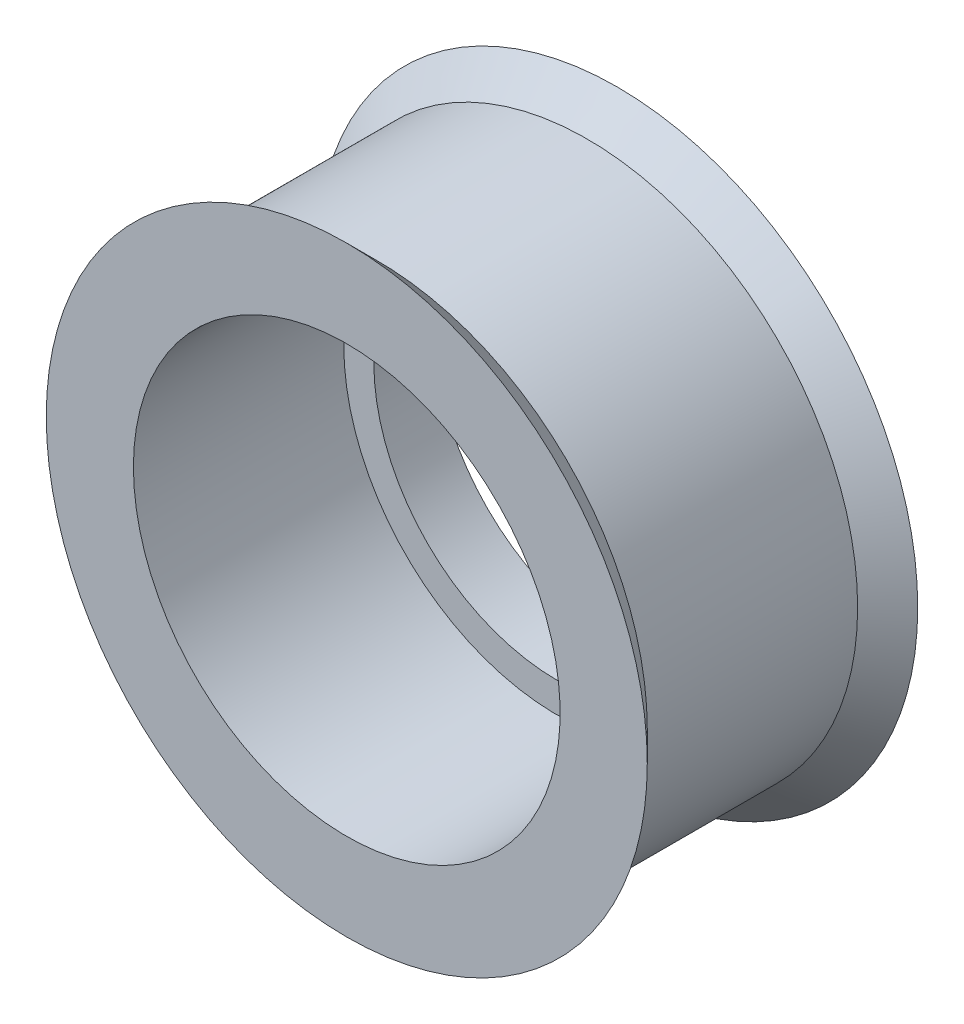
ISO-10303-21;
HEADER;
FILE_DESCRIPTION(('STEP AP214'),'2;1');
FILE_NAME('part.step','',(''),(''),'','','');
FILE_SCHEMA(('AUTOMOTIVE_DESIGN { 1 0 10303 214 1 1 1 1 }'));
ENDSEC;
DATA;
#1=APPLICATION_CONTEXT('core data for automotive mechanical design processes');
#2=APPLICATION_PROTOCOL_DEFINITION('international standard','automotive_design',2000,#1);
#3=PRODUCT_CONTEXT('',#1,'mechanical');
#4=PRODUCT('Part','Part','',(#3));
#5=PRODUCT_RELATED_PRODUCT_CATEGORY('part','',(#4));
#6=PRODUCT_DEFINITION_FORMATION('','',#4);
#7=PRODUCT_DEFINITION_CONTEXT('part definition',#1,'design');
#8=PRODUCT_DEFINITION('design','',#6,#7);
#9=PRODUCT_DEFINITION_SHAPE('','',#8);
#10=(LENGTH_UNIT() NAMED_UNIT(*) SI_UNIT(.MILLI.,.METRE.));
#11=(NAMED_UNIT(*) PLANE_ANGLE_UNIT() SI_UNIT($,.RADIAN.));
#12=(NAMED_UNIT(*) SI_UNIT($,.STERADIAN.) SOLID_ANGLE_UNIT());
#13=UNCERTAINTY_MEASURE_WITH_UNIT(LENGTH_MEASURE(1.E-05),#10,'distance_accuracy_value','');
#14=(GEOMETRIC_REPRESENTATION_CONTEXT(3) GLOBAL_UNCERTAINTY_ASSIGNED_CONTEXT((#13)) GLOBAL_UNIT_ASSIGNED_CONTEXT((#10,
#11,#12)) REPRESENTATION_CONTEXT('',''));
#15=CARTESIAN_POINT('',(0.,0.,0.));
#16=DIRECTION('',(0.,0.,1.));
#17=DIRECTION('',(1.,0.,0.));
#18=AXIS2_PLACEMENT_3D('',#15,#16,#17);
#19=CARTESIAN_POINT('',(0.,0.,4.5));
#20=DIRECTION('',(0.,0.,-0.999999999999999));
#21=DIRECTION('',(-0.999999999999999,0.,0.));
#22=AXIS2_PLACEMENT_3D('',#19,#20,#21);
#23=CYLINDRICAL_SURFACE('',#22,7.1);
#24=CARTESIAN_POINT('',(0.,0.,4.5));
#25=DIRECTION('',(0.,0.,0.999999999999999));
#26=DIRECTION('',(0.999999999999999,0.,0.));
#27=AXIS2_PLACEMENT_3D('',#24,#25,#26);
#28=CIRCLE('',#27,7.1);
#29=CARTESIAN_POINT('',(-7.1,0.,4.5));
#30=VERTEX_POINT('',#29);
#31=EDGE_CURVE('E46',#30,#30,#28,.T.);
#32=CARTESIAN_POINT('',(0.,0.,-2.5));
#33=DIRECTION('',(0.,0.,-0.999999999999999));
#34=DIRECTION('',(-0.999999999999999,0.,0.));
#35=AXIS2_PLACEMENT_3D('',#32,#33,#34);
#36=CIRCLE('',#35,7.1);
#37=CARTESIAN_POINT('',(-7.1,0.,-2.5));
#38=VERTEX_POINT('',#37);
#39=EDGE_CURVE('E56',#38,#38,#36,.T.);
#40=CARTESIAN_POINT('',(-7.1,0.,4.5));
#41=CARTESIAN_POINT('',(-7.1,0.,4.42708333333333));
#42=CARTESIAN_POINT('',(-7.1,0.,4.35416666666666));
#43=CARTESIAN_POINT('',(-7.1,0.,4.20833333333333));
#44=CARTESIAN_POINT('',(-7.1,0.,4.13541666666666));
#45=CARTESIAN_POINT('',(-7.1,0.,3.98958333333333));
#46=CARTESIAN_POINT('',(-7.1,0.,3.91666666666666));
#47=CARTESIAN_POINT('',(-7.1,0.,3.77083333333333));
#48=CARTESIAN_POINT('',(-7.1,0.,3.69791666666666));
#49=CARTESIAN_POINT('',(-7.1,0.,3.55208333333333));
#50=CARTESIAN_POINT('',(-7.1,0.,3.47916666666666));
#51=CARTESIAN_POINT('',(-7.1,0.,3.33333333333333));
#52=CARTESIAN_POINT('',(-7.1,0.,3.26041666666666));
#53=CARTESIAN_POINT('',(-7.1,0.,3.11458333333333));
#54=CARTESIAN_POINT('',(-7.1,0.,3.04166666666666));
#55=CARTESIAN_POINT('',(-7.1,0.,2.89583333333333));
#56=CARTESIAN_POINT('',(-7.1,0.,2.82291666666666));
#57=CARTESIAN_POINT('',(-7.1,0.,2.67708333333333));
#58=CARTESIAN_POINT('',(-7.1,0.,2.60416666666666));
#59=CARTESIAN_POINT('',(-7.1,0.,2.45833333333333));
#60=CARTESIAN_POINT('',(-7.1,0.,2.38541666666666));
#61=CARTESIAN_POINT('',(-7.1,0.,2.23958333333333));
#62=CARTESIAN_POINT('',(-7.1,0.,2.16666666666666));
#63=CARTESIAN_POINT('',(-7.1,0.,2.02083333333333));
#64=CARTESIAN_POINT('',(-7.1,0.,1.94791666666666));
#65=CARTESIAN_POINT('',(-7.1,0.,1.80208333333333));
#66=CARTESIAN_POINT('',(-7.1,0.,1.72916666666666));
#67=CARTESIAN_POINT('',(-7.1,0.,1.58333333333333));
#68=CARTESIAN_POINT('',(-7.1,0.,1.51041666666666));
#69=CARTESIAN_POINT('',(-7.1,0.,1.36458333333333));
#70=CARTESIAN_POINT('',(-7.1,0.,1.29166666666666));
#71=CARTESIAN_POINT('',(-7.1,0.,1.14583333333333));
#72=CARTESIAN_POINT('',(-7.1,0.,1.07291666666666));
#73=CARTESIAN_POINT('',(-7.1,0.,0.927083333333331));
#74=CARTESIAN_POINT('',(-7.1,0.,0.854166666666665));
#75=CARTESIAN_POINT('',(-7.1,0.,0.708333333333332));
#76=CARTESIAN_POINT('',(-7.1,0.,0.635416666666665));
#77=CARTESIAN_POINT('',(-7.1,0.,0.489583333333332));
#78=CARTESIAN_POINT('',(-7.1,0.,0.416666666666665));
#79=CARTESIAN_POINT('',(-7.1,0.,0.270833333333332));
#80=CARTESIAN_POINT('',(-7.1,0.,0.197916666666665));
#81=CARTESIAN_POINT('',(-7.1,0.,0.0520833333333319));
#82=CARTESIAN_POINT('',(-7.1,0.,-0.0208333333333345));
#83=CARTESIAN_POINT('',(-7.1,0.,-0.166666666666668));
#84=CARTESIAN_POINT('',(-7.1,0.,-0.239583333333334));
#85=CARTESIAN_POINT('',(-7.1,0.,-0.385416666666668));
#86=CARTESIAN_POINT('',(-7.1,0.,-0.458333333333335));
#87=CARTESIAN_POINT('',(-7.1,0.,-0.604166666666668));
#88=CARTESIAN_POINT('',(-7.1,0.,-0.677083333333335));
#89=CARTESIAN_POINT('',(-7.1,0.,-0.822916666666668));
#90=CARTESIAN_POINT('',(-7.1,0.,-0.895833333333335));
#91=CARTESIAN_POINT('',(-7.1,0.,-1.04166666666667));
#92=CARTESIAN_POINT('',(-7.1,0.,-1.11458333333334));
#93=CARTESIAN_POINT('',(-7.1,0.,-1.26041666666667));
#94=CARTESIAN_POINT('',(-7.1,0.,-1.33333333333333));
#95=CARTESIAN_POINT('',(-7.1,0.,-1.47916666666667));
#96=CARTESIAN_POINT('',(-7.1,0.,-1.55208333333333));
#97=CARTESIAN_POINT('',(-7.1,0.,-1.69791666666667));
#98=CARTESIAN_POINT('',(-7.1,0.,-1.77083333333333));
#99=CARTESIAN_POINT('',(-7.1,0.,-1.91666666666667));
#100=CARTESIAN_POINT('',(-7.1,0.,-1.98958333333333));
#101=CARTESIAN_POINT('',(-7.1,0.,-2.13541666666667));
#102=CARTESIAN_POINT('',(-7.1,0.,-2.20833333333333));
#103=CARTESIAN_POINT('',(-7.1,0.,-2.35416666666667));
#104=CARTESIAN_POINT('',(-7.1,0.,-2.42708333333333));
#105=CARTESIAN_POINT('',(-7.1,0.,-2.5));
#106=B_SPLINE_CURVE_WITH_KNOTS('',3,(#40,#41,#42,#43,#44,#45,#46,#47,#48,#49,#50,#51,#52,#53,
#54,#55,#56,#57,#58,#59,#60,#61,#62,#63,#64,#65,#66,#67,#68,#69,#70,#71,#72,#73,#74,#75,#76,#77,
#78,#79,#80,#81,#82,#83,#84,#85,#86,#87,#88,#89,#90,#91,#92,#93,#94,#95,#96,#97,#98,#99,#100,
#101,#102,#103,#104,#105),.UNSPECIFIED.,.F.,.F.,(4,2,2,2,2,2,2,2,2,2,2,2,2,2,2,2,2,2,2,2,2,2,2,
2,2,2,2,2,2,2,2,2,4),(0.,0.21875,0.4375,0.656250000000001,0.875,1.09375,1.3125,1.53125,1.75,
1.96875,2.1875,2.40625,2.625,2.84375,3.0625,3.28125,3.5,3.71875,3.9375,4.15625,4.375,4.59375,
4.8125,5.03125,5.25,5.46875,5.6875,5.90625,6.125,6.34375,6.5625,6.78125,7.),.UNSPECIFIED.);
#107=EDGE_CURVE('BSEAM37',#30,#38,#106,.T.);
#108=ORIENTED_EDGE('',*,*,#31,.T.);
#109=ORIENTED_EDGE('',*,*,#39,.T.);
#110=ORIENTED_EDGE('',*,*,#107,.T.);
#111=ORIENTED_EDGE('',*,*,#107,.F.);
#112=EDGE_LOOP('',(#108,#110,#109,#111));
#113=FACE_BOUND('',#112,.T.);
#114=ADVANCED_FACE('F37',(#113),#23,.F.);
#115=CARTESIAN_POINT('',(0.,0.,4.5));
#116=DIRECTION('',(0.,0.,0.999999999999999));
#117=DIRECTION('',(0.999999999999999,0.,0.));
#118=AXIS2_PLACEMENT_3D('',#115,#116,#117);
#119=PLANE('',#118);
#120=ORIENTED_EDGE('',*,*,#31,.F.);
#121=EDGE_LOOP('',(#120));
#122=FACE_BOUND('',#121,.T.);
#123=CARTESIAN_POINT('',(0.,0.,4.5));
#124=DIRECTION('',(0.,0.,0.999999999999999));
#125=DIRECTION('',(0.999999999999999,0.,0.));
#126=AXIS2_PLACEMENT_3D('',#123,#124,#125);
#127=CIRCLE('',#126,10.);
#128=CARTESIAN_POINT('',(9.99999999999999,0.,4.5));
#129=VERTEX_POINT('',#128);
#130=EDGE_CURVE('E10',#129,#129,#127,.T.);
#131=ORIENTED_EDGE('',*,*,#130,.T.);
#132=EDGE_LOOP('',(#131));
#133=FACE_BOUND('',#132,.T.);
#134=ADVANCED_FACE('F80',(#122,#133),#119,.T.);
#135=CARTESIAN_POINT('',(0.,0.,-4.5));
#136=DIRECTION('',(0.,0.,0.999999999999999));
#137=DIRECTION('',(0.999999999999999,0.,0.));
#138=AXIS2_PLACEMENT_3D('',#135,#136,#137);
#139=PLANE('',#138);
#140=CARTESIAN_POINT('',(0.,0.,-4.5));
#141=DIRECTION('',(0.,0.,0.999999999999999));
#142=DIRECTION('',(0.999999999999999,0.,0.));
#143=AXIS2_PLACEMENT_3D('',#140,#141,#142);
#144=CIRCLE('',#143,10.);
#145=CARTESIAN_POINT('',(9.99999999999999,0.,-4.5));
#146=VERTEX_POINT('',#145);
#147=EDGE_CURVE('E42',#146,#146,#144,.T.);
#148=ORIENTED_EDGE('',*,*,#147,.F.);
#149=EDGE_LOOP('',(#148));
#150=FACE_BOUND('',#149,.T.);
#151=CARTESIAN_POINT('',(0.,0.,-4.5));
#152=DIRECTION('',(0.,0.,-0.999999999999999));
#153=DIRECTION('',(-0.999999999999999,0.,0.));
#154=AXIS2_PLACEMENT_3D('',#151,#152,#153);
#155=CIRCLE('',#154,6.1);
#156=CARTESIAN_POINT('',(-6.1,0.,-4.5));
#157=VERTEX_POINT('',#156);
#158=EDGE_CURVE('E62',#157,#157,#155,.T.);
#159=ORIENTED_EDGE('',*,*,#158,.F.);
#160=EDGE_LOOP('',(#159));
#161=FACE_BOUND('',#160,.T.);
#162=ADVANCED_FACE('F77',(#150,#161),#139,.F.);
#163=CARTESIAN_POINT('',(0.,0.,-3.5));
#164=DIRECTION('',(0.,0.,0.999999999999999));
#165=DIRECTION('',(0.999999999999999,0.,0.));
#166=AXIS2_PLACEMENT_3D('',#163,#164,#165);
#167=CYLINDRICAL_SURFACE('',#166,9.);
#168=CARTESIAN_POINT('',(0.,0.,-3.5));
#169=DIRECTION('',(0.,0.,0.999999999999999));
#170=DIRECTION('',(0.999999999999999,0.,0.));
#171=AXIS2_PLACEMENT_3D('',#168,#169,#170);
#172=CIRCLE('',#171,9.);
#173=CARTESIAN_POINT('',(8.99999999999999,0.,-3.5));
#174=VERTEX_POINT('',#173);
#175=EDGE_CURVE('E55',#174,#174,#172,.T.);
#176=CARTESIAN_POINT('',(0.,0.,3.5));
#177=DIRECTION('',(0.,0.,0.999999999999999));
#178=DIRECTION('',(0.999999999999999,0.,0.));
#179=AXIS2_PLACEMENT_3D('',#176,#177,#178);
#180=CIRCLE('',#179,9.);
#181=CARTESIAN_POINT('',(8.99999999999999,0.,3.5));
#182=VERTEX_POINT('',#181);
#183=EDGE_CURVE('E52',#182,#182,#180,.T.);
#184=CARTESIAN_POINT('',(8.99999999999999,0.,-3.5));
#185=CARTESIAN_POINT('',(8.99999999999999,0.,-3.42708333333334));
#186=CARTESIAN_POINT('',(8.99999999999999,0.,-3.35416666666667));
#187=CARTESIAN_POINT('',(8.99999999999999,0.,-3.20833333333334));
#188=CARTESIAN_POINT('',(8.99999999999999,0.,-3.13541666666667));
#189=CARTESIAN_POINT('',(8.99999999999999,0.,-2.98958333333334));
#190=CARTESIAN_POINT('',(8.99999999999999,0.,-2.91666666666667));
#191=CARTESIAN_POINT('',(8.99999999999999,0.,-2.77083333333334));
#192=CARTESIAN_POINT('',(8.99999999999999,0.,-2.69791666666667));
#193=CARTESIAN_POINT('',(8.99999999999999,0.,-2.55208333333334));
#194=CARTESIAN_POINT('',(8.99999999999999,0.,-2.47916666666667));
#195=CARTESIAN_POINT('',(8.99999999999999,0.,-2.33333333333334));
#196=CARTESIAN_POINT('',(8.99999999999999,0.,-2.26041666666667));
#197=CARTESIAN_POINT('',(8.99999999999999,0.,-2.11458333333334));
#198=CARTESIAN_POINT('',(8.99999999999999,0.,-2.04166666666667));
#199=CARTESIAN_POINT('',(8.99999999999999,0.,-1.89583333333334));
#200=CARTESIAN_POINT('',(8.99999999999999,0.,-1.82291666666667));
#201=CARTESIAN_POINT('',(8.99999999999999,0.,-1.67708333333334));
#202=CARTESIAN_POINT('',(8.99999999999999,0.,-1.60416666666667));
#203=CARTESIAN_POINT('',(8.99999999999999,0.,-1.45833333333334));
#204=CARTESIAN_POINT('',(8.99999999999999,0.,-1.38541666666667));
#205=CARTESIAN_POINT('',(8.99999999999999,0.,-1.23958333333334));
#206=CARTESIAN_POINT('',(8.99999999999999,0.,-1.16666666666667));
#207=CARTESIAN_POINT('',(8.99999999999999,0.,-1.02083333333334));
#208=CARTESIAN_POINT('',(8.99999999999999,0.,-0.947916666666668));
#209=CARTESIAN_POINT('',(8.99999999999999,0.,-0.802083333333335));
#210=CARTESIAN_POINT('',(8.99999999999999,0.,-0.729166666666668));
#211=CARTESIAN_POINT('',(8.99999999999999,0.,-0.583333333333335));
#212=CARTESIAN_POINT('',(8.99999999999999,0.,-0.510416666666668));
#213=CARTESIAN_POINT('',(8.99999999999999,0.,-0.364583333333335));
#214=CARTESIAN_POINT('',(8.99999999999999,0.,-0.291666666666668));
#215=CARTESIAN_POINT('',(8.99999999999999,0.,-0.145833333333334));
#216=CARTESIAN_POINT('',(8.99999999999999,0.,-0.0729166666666676));
#217=CARTESIAN_POINT('',(8.99999999999999,0.,0.0729166666666657));
#218=CARTESIAN_POINT('',(8.99999999999999,0.,0.145833333333332));
#219=CARTESIAN_POINT('',(8.99999999999999,0.,0.291666666666666));
#220=CARTESIAN_POINT('',(8.99999999999999,0.,0.364583333333333));
#221=CARTESIAN_POINT('',(8.99999999999999,0.,0.510416666666666));
#222=CARTESIAN_POINT('',(8.99999999999999,0.,0.583333333333333));
#223=CARTESIAN_POINT('',(8.99999999999999,0.,0.729166666666667));
#224=CARTESIAN_POINT('',(8.99999999999999,0.,0.802083333333333));
#225=CARTESIAN_POINT('',(8.99999999999999,0.,0.947916666666667));
#226=CARTESIAN_POINT('',(8.99999999999999,0.,1.02083333333333));
#227=CARTESIAN_POINT('',(8.99999999999999,0.,1.16666666666667));
#228=CARTESIAN_POINT('',(8.99999999999999,0.,1.23958333333333));
#229=CARTESIAN_POINT('',(8.99999999999999,0.,1.38541666666667));
#230=CARTESIAN_POINT('',(8.99999999999999,0.,1.45833333333333));
#231=CARTESIAN_POINT('',(8.99999999999999,0.,1.60416666666667));
#232=CARTESIAN_POINT('',(8.99999999999999,0.,1.67708333333333));
#233=CARTESIAN_POINT('',(8.99999999999999,0.,1.82291666666667));
#234=CARTESIAN_POINT('',(8.99999999999999,0.,1.89583333333333));
#235=CARTESIAN_POINT('',(8.99999999999999,0.,2.04166666666667));
#236=CARTESIAN_POINT('',(8.99999999999999,0.,2.11458333333333));
#237=CARTESIAN_POINT('',(8.99999999999999,0.,2.26041666666667));
#238=CARTESIAN_POINT('',(8.99999999999999,0.,2.33333333333333));
#239=CARTESIAN_POINT('',(8.99999999999999,0.,2.47916666666667));
#240=CARTESIAN_POINT('',(8.99999999999999,0.,2.55208333333333));
#241=CARTESIAN_POINT('',(8.99999999999999,0.,2.69791666666667));
#242=CARTESIAN_POINT('',(8.99999999999999,0.,2.77083333333333));
#243=CARTESIAN_POINT('',(8.99999999999999,0.,2.91666666666667));
#244=CARTESIAN_POINT('',(8.99999999999999,0.,2.98958333333333));
#245=CARTESIAN_POINT('',(8.99999999999999,0.,3.13541666666667));
#246=CARTESIAN_POINT('',(8.99999999999999,0.,3.20833333333334));
#247=CARTESIAN_POINT('',(8.99999999999999,0.,3.35416666666667));
#248=CARTESIAN_POINT('',(8.99999999999999,0.,3.42708333333334));
#249=CARTESIAN_POINT('',(8.99999999999999,0.,3.5));
#250=B_SPLINE_CURVE_WITH_KNOTS('',3,(#184,#185,#186,#187,#188,#189,#190,#191,#192,#193,#194,
#195,#196,#197,#198,#199,#200,#201,#202,#203,#204,#205,#206,#207,#208,#209,#210,#211,#212,#213,
#214,#215,#216,#217,#218,#219,#220,#221,#222,#223,#224,#225,#226,#227,#228,#229,#230,#231,#232,
#233,#234,#235,#236,#237,#238,#239,#240,#241,#242,#243,#244,#245,#246,#247,#248,#249),
.UNSPECIFIED.,.F.,.F.,(4,2,2,2,2,2,2,2,2,2,2,2,2,2,2,2,2,2,2,2,2,2,2,2,2,2,2,2,2,2,2,2,4),(0.,
0.21875,0.4375,0.656250000000001,0.875000000000001,1.09375,1.3125,1.53125,1.75,1.96875,2.1875,
2.40625,2.625,2.84375,3.0625,3.28125,3.5,3.71875,3.9375,4.15625,4.375,4.59375,4.8125,5.03125,
5.25,5.46875,5.68750000000001,5.90625,6.12500000000001,6.34375000000001,6.56250000000001,
6.78125000000001,7.00000000000001),.UNSPECIFIED.);
#251=EDGE_CURVE('BSEAM79',#174,#182,#250,.T.);
#252=ORIENTED_EDGE('',*,*,#175,.T.);
#253=ORIENTED_EDGE('',*,*,#183,.F.);
#254=ORIENTED_EDGE('',*,*,#251,.T.);
#255=ORIENTED_EDGE('',*,*,#251,.F.);
#256=EDGE_LOOP('',(#252,#254,#253,#255));
#257=FACE_BOUND('',#256,.T.);
#258=ADVANCED_FACE('F79',(#257),#167,.T.);
#259=CARTESIAN_POINT('',(0.,0.,4.5));
#260=DIRECTION('',(0.,0.,0.999999999999999));
#261=DIRECTION('',(0.999999999999999,0.,0.));
#262=AXIS2_PLACEMENT_3D('',#259,#260,#261);
#263=CONICAL_SURFACE('',#262,10.,0.78539816339745);
#264=CARTESIAN_POINT('',(9.,0.,3.5));
#265=CARTESIAN_POINT('',(9.01041666666666,0.,3.51041666666667));
#266=CARTESIAN_POINT('',(9.02083333333333,0.,3.52083333333334));
#267=CARTESIAN_POINT('',(9.04166666666666,0.,3.54166666666667));
#268=CARTESIAN_POINT('',(9.05208333333333,0.,3.55208333333334));
#269=CARTESIAN_POINT('',(9.07291666666666,0.,3.57291666666667));
#270=CARTESIAN_POINT('',(9.08333333333333,0.,3.58333333333334));
#271=CARTESIAN_POINT('',(9.10416666666666,0.,3.60416666666667));
#272=CARTESIAN_POINT('',(9.11458333333333,0.,3.61458333333334));
#273=CARTESIAN_POINT('',(9.13541666666666,0.,3.63541666666667));
#274=CARTESIAN_POINT('',(9.14583333333333,0.,3.64583333333334));
#275=CARTESIAN_POINT('',(9.16666666666666,0.,3.66666666666667));
#276=CARTESIAN_POINT('',(9.17708333333333,0.,3.67708333333334));
#277=CARTESIAN_POINT('',(9.19791666666666,0.,3.69791666666667));
#278=CARTESIAN_POINT('',(9.20833333333333,0.,3.70833333333333));
#279=CARTESIAN_POINT('',(9.22916666666666,0.,3.72916666666667));
#280=CARTESIAN_POINT('',(9.23958333333333,0.,3.73958333333333));
#281=CARTESIAN_POINT('',(9.26041666666666,0.,3.76041666666667));
#282=CARTESIAN_POINT('',(9.27083333333333,0.,3.77083333333333));
#283=CARTESIAN_POINT('',(9.29166666666666,0.,3.79166666666667));
#284=CARTESIAN_POINT('',(9.30208333333333,0.,3.80208333333333));
#285=CARTESIAN_POINT('',(9.32291666666666,0.,3.82291666666667));
#286=CARTESIAN_POINT('',(9.33333333333333,0.,3.83333333333333));
#287=CARTESIAN_POINT('',(9.35416666666666,0.,3.85416666666667));
#288=CARTESIAN_POINT('',(9.36458333333333,0.,3.86458333333333));
#289=CARTESIAN_POINT('',(9.38541666666666,0.,3.88541666666667));
#290=CARTESIAN_POINT('',(9.39583333333333,0.,3.89583333333333));
#291=CARTESIAN_POINT('',(9.41666666666666,0.,3.91666666666667));
#292=CARTESIAN_POINT('',(9.42708333333333,0.,3.92708333333333));
#293=CARTESIAN_POINT('',(9.44791666666666,0.,3.94791666666667));
#294=CARTESIAN_POINT('',(9.45833333333333,0.,3.95833333333333));
#295=CARTESIAN_POINT('',(9.47916666666666,0.,3.97916666666667));
#296=CARTESIAN_POINT('',(9.48958333333333,0.,3.98958333333333));
#297=CARTESIAN_POINT('',(9.51041666666666,0.,4.01041666666667));
#298=CARTESIAN_POINT('',(9.52083333333333,0.,4.02083333333333));
#299=CARTESIAN_POINT('',(9.54166666666666,0.,4.04166666666667));
#300=CARTESIAN_POINT('',(9.55208333333333,0.,4.05208333333333));
#301=CARTESIAN_POINT('',(9.57291666666666,0.,4.07291666666667));
#302=CARTESIAN_POINT('',(9.58333333333333,0.,4.08333333333333));
#303=CARTESIAN_POINT('',(9.60416666666666,0.,4.10416666666667));
#304=CARTESIAN_POINT('',(9.61458333333333,0.,4.11458333333333));
#305=CARTESIAN_POINT('',(9.63541666666666,0.,4.13541666666667));
#306=CARTESIAN_POINT('',(9.64583333333333,0.,4.14583333333333));
#307=CARTESIAN_POINT('',(9.66666666666666,0.,4.16666666666667));
#308=CARTESIAN_POINT('',(9.67708333333333,0.,4.17708333333333));
#309=CARTESIAN_POINT('',(9.69791666666666,0.,4.19791666666667));
#310=CARTESIAN_POINT('',(9.70833333333333,0.,4.20833333333333));
#311=CARTESIAN_POINT('',(9.72916666666666,0.,4.22916666666667));
#312=CARTESIAN_POINT('',(9.73958333333333,0.,4.23958333333333));
#313=CARTESIAN_POINT('',(9.76041666666666,0.,4.26041666666667));
#314=CARTESIAN_POINT('',(9.77083333333333,0.,4.27083333333333));
#315=CARTESIAN_POINT('',(9.79166666666666,0.,4.29166666666666));
#316=CARTESIAN_POINT('',(9.80208333333333,0.,4.30208333333333));
#317=CARTESIAN_POINT('',(9.82291666666666,0.,4.32291666666666));
#318=CARTESIAN_POINT('',(9.83333333333333,0.,4.33333333333333));
#319=CARTESIAN_POINT('',(9.85416666666666,0.,4.35416666666666));
#320=CARTESIAN_POINT('',(9.86458333333333,0.,4.36458333333333));
#321=CARTESIAN_POINT('',(9.88541666666666,0.,4.38541666666666));
#322=CARTESIAN_POINT('',(9.89583333333333,0.,4.39583333333333));
#323=CARTESIAN_POINT('',(9.91666666666666,0.,4.41666666666666));
#324=CARTESIAN_POINT('',(9.92708333333333,0.,4.42708333333333));
#325=CARTESIAN_POINT('',(9.94791666666666,0.,4.44791666666666));
#326=CARTESIAN_POINT('',(9.95833333333333,0.,4.45833333333333));
#327=CARTESIAN_POINT('',(9.97916666666666,0.,4.47916666666666));
#328=CARTESIAN_POINT('',(9.98958333333333,0.,4.48958333333333));
#329=CARTESIAN_POINT('',(9.99999999999999,0.,4.5));
#330=B_SPLINE_CURVE_WITH_KNOTS('',3,(#264,#265,#266,#267,#268,#269,#270,#271,#272,#273,#274,
#275,#276,#277,#278,#279,#280,#281,#282,#283,#284,#285,#286,#287,#288,#289,#290,#291,#292,#293,
#294,#295,#296,#297,#298,#299,#300,#301,#302,#303,#304,#305,#306,#307,#308,#309,#310,#311,#312,
#313,#314,#315,#316,#317,#318,#319,#320,#321,#322,#323,#324,#325,#326,#327,#328,#329),
.UNSPECIFIED.,.F.,.F.,(4,2,2,2,2,2,2,2,2,2,2,2,2,2,2,2,2,2,2,2,2,2,2,2,2,2,2,2,2,2,2,2,4),(0.,
0.044194173824159,0.0883883476483179,0.132582521472477,0.176776695296635,0.220970869120794,
0.265165042944953,0.309359216769112,0.353553390593272,0.397747564417431,0.44194173824159,
0.486135912065749,0.530330085889908,0.574524259714067,0.618718433538226,0.662912607362385,
0.707106781186545,0.751300955010702,0.795495128834861,0.839689302659021,0.88388347648318,
0.928077650307338,0.972271824131498,1.01646599795566,1.06066017177982,1.10485434560397,
1.14904851942813,1.19324269325229,1.23743686707645,1.28163104090061,1.32582521472477,
1.37001938854893,1.41421356237309),.UNSPECIFIED.);
#331=EDGE_CURVE('BSEAM87',#182,#129,#330,.T.);
#332=ORIENTED_EDGE('',*,*,#183,.T.);
#333=ORIENTED_EDGE('',*,*,#130,.F.);
#334=ORIENTED_EDGE('',*,*,#331,.T.);
#335=ORIENTED_EDGE('',*,*,#331,.F.);
#336=EDGE_LOOP('',(#332,#334,#333,#335));
#337=FACE_BOUND('',#336,.T.);
#338=ADVANCED_FACE('F87',(#337),#263,.T.);
#339=CARTESIAN_POINT('',(0.,0.,-3.5));
#340=DIRECTION('',(0.,0.,-0.999999999999999));
#341=DIRECTION('',(-0.999999999999999,0.,0.));
#342=AXIS2_PLACEMENT_3D('',#339,#340,#341);
#343=CONICAL_SURFACE('',#342,9.,0.785398163397447);
#344=ORIENTED_EDGE('',*,*,#147,.T.);
#345=EDGE_LOOP('',(#344));
#346=FACE_BOUND('',#345,.T.);
#347=ORIENTED_EDGE('',*,*,#175,.F.);
#348=EDGE_LOOP('',(#347));
#349=FACE_BOUND('',#348,.T.);
#350=ADVANCED_FACE('F40',(#346,#349),#343,.T.);
#351=CARTESIAN_POINT('',(0.,0.,-2.5));
#352=DIRECTION('',(0.,0.,-0.999999999999999));
#353=DIRECTION('',(-0.999999999999999,0.,0.));
#354=AXIS2_PLACEMENT_3D('',#351,#352,#353);
#355=PLANE('',#354);
#356=CARTESIAN_POINT('',(0.,0.,-2.5));
#357=DIRECTION('',(0.,0.,-0.999999999999999));
#358=DIRECTION('',(-0.999999999999999,0.,0.));
#359=AXIS2_PLACEMENT_3D('',#356,#357,#358);
#360=CIRCLE('',#359,6.1);
#361=CARTESIAN_POINT('',(-6.1,0.,-2.5));
#362=VERTEX_POINT('',#361);
#363=EDGE_CURVE('E61',#362,#362,#360,.T.);
#364=ORIENTED_EDGE('',*,*,#363,.T.);
#365=EDGE_LOOP('',(#364));
#366=FACE_BOUND('',#365,.T.);
#367=ORIENTED_EDGE('',*,*,#39,.F.);
#368=EDGE_LOOP('',(#367));
#369=FACE_BOUND('',#368,.T.);
#370=ADVANCED_FACE('F68',(#366,#369),#355,.F.);
#371=CARTESIAN_POINT('',(0.,0.,-2.5));
#372=DIRECTION('',(0.,0.,-0.999999999999999));
#373=DIRECTION('',(-0.999999999999999,0.,0.));
#374=AXIS2_PLACEMENT_3D('',#371,#372,#373);
#375=CYLINDRICAL_SURFACE('',#374,6.1);
#376=CARTESIAN_POINT('',(-6.1,0.,-2.5));
#377=CARTESIAN_POINT('',(-6.1,0.,-2.52083333333334));
#378=CARTESIAN_POINT('',(-6.1,0.,-2.54166666666667));
#379=CARTESIAN_POINT('',(-6.1,0.,-2.58333333333334));
#380=CARTESIAN_POINT('',(-6.1,0.,-2.60416666666667));
#381=CARTESIAN_POINT('',(-6.1,0.,-2.64583333333333));
#382=CARTESIAN_POINT('',(-6.1,0.,-2.66666666666667));
#383=CARTESIAN_POINT('',(-6.1,0.,-2.70833333333333));
#384=CARTESIAN_POINT('',(-6.1,0.,-2.72916666666667));
#385=CARTESIAN_POINT('',(-6.1,0.,-2.77083333333333));
#386=CARTESIAN_POINT('',(-6.1,0.,-2.79166666666667));
#387=CARTESIAN_POINT('',(-6.1,0.,-2.83333333333333));
#388=CARTESIAN_POINT('',(-6.1,0.,-2.85416666666667));
#389=CARTESIAN_POINT('',(-6.1,0.,-2.89583333333333));
#390=CARTESIAN_POINT('',(-6.1,0.,-2.91666666666667));
#391=CARTESIAN_POINT('',(-6.1,0.,-2.95833333333333));
#392=CARTESIAN_POINT('',(-6.1,0.,-2.97916666666667));
#393=CARTESIAN_POINT('',(-6.1,0.,-3.02083333333333));
#394=CARTESIAN_POINT('',(-6.1,0.,-3.04166666666667));
#395=CARTESIAN_POINT('',(-6.1,0.,-3.08333333333333));
#396=CARTESIAN_POINT('',(-6.1,0.,-3.10416666666667));
#397=CARTESIAN_POINT('',(-6.1,0.,-3.14583333333333));
#398=CARTESIAN_POINT('',(-6.1,0.,-3.16666666666667));
#399=CARTESIAN_POINT('',(-6.1,0.,-3.20833333333333));
#400=CARTESIAN_POINT('',(-6.1,0.,-3.22916666666667));
#401=CARTESIAN_POINT('',(-6.1,0.,-3.27083333333333));
#402=CARTESIAN_POINT('',(-6.1,0.,-3.29166666666667));
#403=CARTESIAN_POINT('',(-6.1,0.,-3.33333333333333));
#404=CARTESIAN_POINT('',(-6.1,0.,-3.35416666666667));
#405=CARTESIAN_POINT('',(-6.1,0.,-3.39583333333333));
#406=CARTESIAN_POINT('',(-6.1,0.,-3.41666666666667));
#407=CARTESIAN_POINT('',(-6.1,0.,-3.45833333333333));
#408=CARTESIAN_POINT('',(-6.1,0.,-3.47916666666667));
#409=CARTESIAN_POINT('',(-6.1,0.,-3.52083333333333));
#410=CARTESIAN_POINT('',(-6.1,0.,-3.54166666666667));
#411=CARTESIAN_POINT('',(-6.1,0.,-3.58333333333333));
#412=CARTESIAN_POINT('',(-6.1,0.,-3.60416666666667));
#413=CARTESIAN_POINT('',(-6.1,0.,-3.64583333333333));
#414=CARTESIAN_POINT('',(-6.1,0.,-3.66666666666667));
#415=CARTESIAN_POINT('',(-6.1,0.,-3.70833333333333));
#416=CARTESIAN_POINT('',(-6.1,0.,-3.72916666666666));
#417=CARTESIAN_POINT('',(-6.1,0.,-3.77083333333333));
#418=CARTESIAN_POINT('',(-6.1,0.,-3.79166666666667));
#419=CARTESIAN_POINT('',(-6.1,0.,-3.83333333333333));
#420=CARTESIAN_POINT('',(-6.1,0.,-3.85416666666667));
#421=CARTESIAN_POINT('',(-6.1,0.,-3.89583333333333));
#422=CARTESIAN_POINT('',(-6.1,0.,-3.91666666666666));
#423=CARTESIAN_POINT('',(-6.1,0.,-3.95833333333333));
#424=CARTESIAN_POINT('',(-6.1,0.,-3.97916666666666));
#425=CARTESIAN_POINT('',(-6.1,0.,-4.02083333333333));
#426=CARTESIAN_POINT('',(-6.1,0.,-4.04166666666666));
#427=CARTESIAN_POINT('',(-6.1,0.,-4.08333333333333));
#428=CARTESIAN_POINT('',(-6.1,0.,-4.10416666666666));
#429=CARTESIAN_POINT('',(-6.1,0.,-4.14583333333333));
#430=CARTESIAN_POINT('',(-6.1,0.,-4.16666666666666));
#431=CARTESIAN_POINT('',(-6.1,0.,-4.20833333333333));
#432=CARTESIAN_POINT('',(-6.1,0.,-4.22916666666666));
#433=CARTESIAN_POINT('',(-6.1,0.,-4.27083333333333));
#434=CARTESIAN_POINT('',(-6.1,0.,-4.29166666666666));
#435=CARTESIAN_POINT('',(-6.1,0.,-4.33333333333333));
#436=CARTESIAN_POINT('',(-6.1,0.,-4.35416666666666));
#437=CARTESIAN_POINT('',(-6.1,0.,-4.39583333333333));
#438=CARTESIAN_POINT('',(-6.1,0.,-4.41666666666666));
#439=CARTESIAN_POINT('',(-6.1,0.,-4.45833333333333));
#440=CARTESIAN_POINT('',(-6.1,0.,-4.47916666666666));
#441=CARTESIAN_POINT('',(-6.1,0.,-4.5));
#442=B_SPLINE_CURVE_WITH_KNOTS('',3,(#376,#377,#378,#379,#380,#381,#382,#383,#384,#385,#386,
#387,#388,#389,#390,#391,#392,#393,#394,#395,#396,#397,#398,#399,#400,#401,#402,#403,#404,#405,
#406,#407,#408,#409,#410,#411,#412,#413,#414,#415,#416,#417,#418,#419,#420,#421,#422,#423,#424,
#425,#426,#427,#428,#429,#430,#431,#432,#433,#434,#435,#436,#437,#438,#439,#440,#441),
.UNSPECIFIED.,.F.,.F.,(4,2,2,2,2,2,2,2,2,2,2,2,2,2,2,2,2,2,2,2,2,2,2,2,2,2,2,2,2,2,2,2,4),(0.,
0.0624999999999996,0.124999999999999,0.187499999999999,0.249999999999999,0.312499999999999,
0.374999999999999,0.437499999999999,0.499999999999998,0.562499999999998,0.624999999999998,
0.687499999999998,0.749999999999998,0.812499999999997,0.874999999999997,0.937499999999997,
0.999999999999997,1.0625,1.125,1.1875,1.25,1.3125,1.375,1.4375,1.5,1.5625,1.625,
1.68749999999999,1.74999999999999,1.81249999999999,1.87499999999999,1.93749999999999,
1.99999999999999),.UNSPECIFIED.);
#443=EDGE_CURVE('BSEAM71',#362,#157,#442,.T.);
#444=ORIENTED_EDGE('',*,*,#363,.F.);
#445=ORIENTED_EDGE('',*,*,#158,.T.);
#446=ORIENTED_EDGE('',*,*,#443,.T.);
#447=ORIENTED_EDGE('',*,*,#443,.F.);
#448=EDGE_LOOP('',(#444,#446,#445,#447));
#449=FACE_BOUND('',#448,.T.);
#450=ADVANCED_FACE('F71',(#449),#375,.F.);
#451=CLOSED_SHELL('',(#114,#134,#162,#258,#338,#350,#370,#450));
#452=MANIFOLD_SOLID_BREP('B2',#451);
#453=ADVANCED_BREP_SHAPE_REPRESENTATION('',(#18,#452),#14);
#454=SHAPE_DEFINITION_REPRESENTATION(#9,#453);
ENDSEC;
END-ISO-10303-21;
